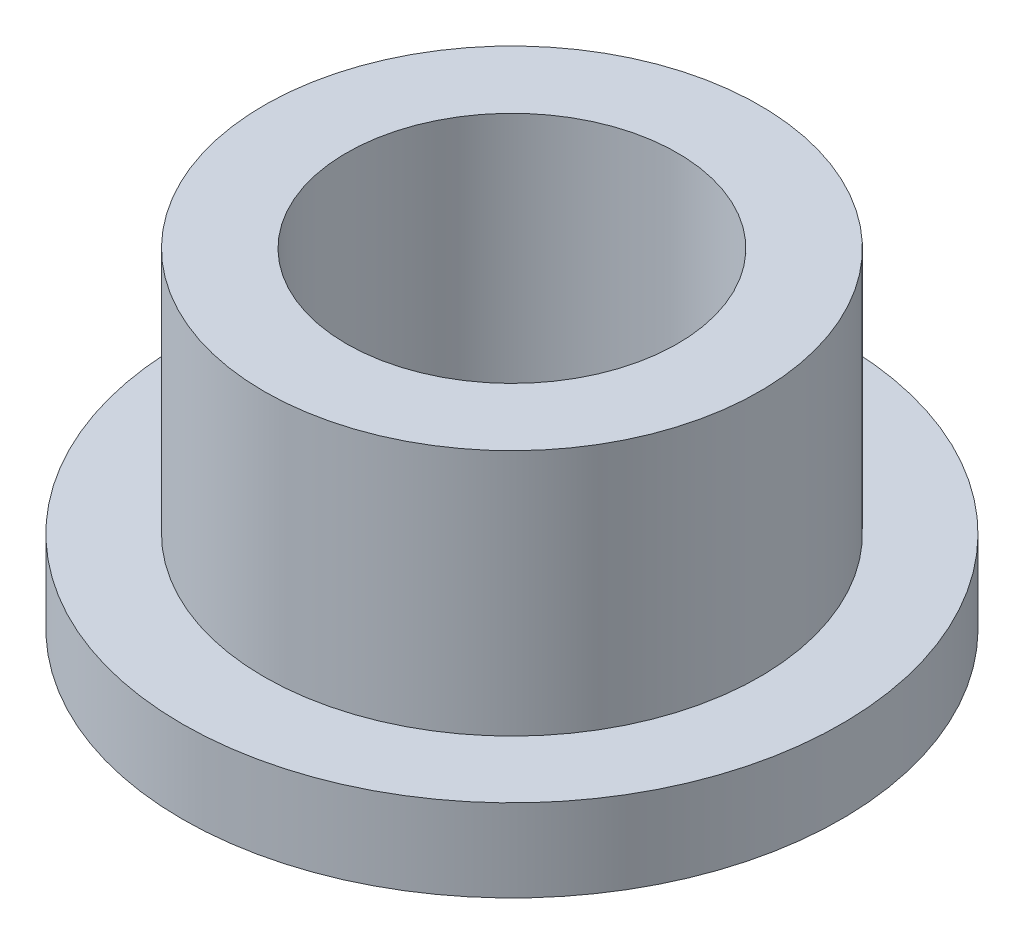
ISO-10303-21;
HEADER;
FILE_DESCRIPTION(('STEP AP214'),'2;1');
FILE_NAME('part.step','',(''),(''),'','','');
FILE_SCHEMA(('AUTOMOTIVE_DESIGN { 1 0 10303 214 1 1 1 1 }'));
ENDSEC;
DATA;
#1=APPLICATION_CONTEXT('core data for automotive mechanical design processes');
#2=APPLICATION_PROTOCOL_DEFINITION('international standard','automotive_design',2000,#1);
#3=PRODUCT_CONTEXT('',#1,'mechanical');
#4=PRODUCT('Part','Part','',(#3));
#5=PRODUCT_RELATED_PRODUCT_CATEGORY('part','',(#4));
#6=PRODUCT_DEFINITION_FORMATION('','',#4);
#7=PRODUCT_DEFINITION_CONTEXT('part definition',#1,'design');
#8=PRODUCT_DEFINITION('design','',#6,#7);
#9=PRODUCT_DEFINITION_SHAPE('','',#8);
#10=(LENGTH_UNIT() NAMED_UNIT(*) SI_UNIT(.MILLI.,.METRE.));
#11=(NAMED_UNIT(*) PLANE_ANGLE_UNIT() SI_UNIT($,.RADIAN.));
#12=(NAMED_UNIT(*) SI_UNIT($,.STERADIAN.) SOLID_ANGLE_UNIT());
#13=UNCERTAINTY_MEASURE_WITH_UNIT(LENGTH_MEASURE(1.E-05),#10,'distance_accuracy_value','');
#14=(GEOMETRIC_REPRESENTATION_CONTEXT(3) GLOBAL_UNCERTAINTY_ASSIGNED_CONTEXT((#13)) GLOBAL_UNIT_ASSIGNED_CONTEXT((#10,
#11,#12)) REPRESENTATION_CONTEXT('',''));
#15=CARTESIAN_POINT('',(0.,0.,0.));
#16=DIRECTION('',(0.,0.,1.));
#17=DIRECTION('',(1.,0.,0.));
#18=AXIS2_PLACEMENT_3D('',#15,#16,#17);
#19=CARTESIAN_POINT('',(0.,12.7,0.));
#20=DIRECTION('',(0.,1.,0.));
#21=DIRECTION('',(0.,0.,1.));
#22=AXIS2_PLACEMENT_3D('',#19,#20,#21);
#23=PLANE('',#22);
#24=CARTESIAN_POINT('',(0.,12.7,0.));
#25=DIRECTION('',(0.,1.,0.));
#26=DIRECTION('',(0.,0.,1.));
#27=AXIS2_PLACEMENT_3D('',#24,#25,#26);
#28=CIRCLE('',#27,9.5504);
#29=CARTESIAN_POINT('',(0.,12.7,9.5504));
#30=VERTEX_POINT('',#29);
#31=EDGE_CURVE('E10',#30,#30,#28,.T.);
#32=ORIENTED_EDGE('',*,*,#31,.T.);
#33=EDGE_LOOP('',(#32));
#34=FACE_BOUND('',#33,.T.);
#35=CARTESIAN_POINT('',(0.,12.7,0.));
#36=DIRECTION('',(0.,1.,0.));
#37=DIRECTION('',(0.,0.,1.));
#38=AXIS2_PLACEMENT_3D('',#35,#36,#37);
#39=CIRCLE('',#38,6.3754);
#40=CARTESIAN_POINT('',(0.,12.7,6.3754));
#41=VERTEX_POINT('',#40);
#42=EDGE_CURVE('E42',#41,#41,#39,.T.);
#43=ORIENTED_EDGE('',*,*,#42,.F.);
#44=EDGE_LOOP('',(#43));
#45=FACE_BOUND('',#44,.T.);
#46=ADVANCED_FACE('F34',(#34,#45),#23,.T.);
#47=CARTESIAN_POINT('',(0.,0.,0.));
#48=DIRECTION('',(0.,1.,0.));
#49=DIRECTION('',(0.,0.,1.));
#50=AXIS2_PLACEMENT_3D('',#47,#48,#49);
#51=PLANE('',#50);
#52=CARTESIAN_POINT('',(0.,0.,0.));
#53=DIRECTION('',(0.,1.,0.));
#54=DIRECTION('',(0.,0.,1.));
#55=AXIS2_PLACEMENT_3D('',#52,#53,#54);
#56=CIRCLE('',#55,6.3754);
#57=CARTESIAN_POINT('',(0.,0.,6.3754));
#58=VERTEX_POINT('',#57);
#59=EDGE_CURVE('E47',#58,#58,#56,.T.);
#60=ORIENTED_EDGE('',*,*,#59,.T.);
#61=EDGE_LOOP('',(#60));
#62=FACE_BOUND('',#61,.T.);
#63=CARTESIAN_POINT('',(0.,0.,0.));
#64=DIRECTION('',(0.,1.,0.));
#65=DIRECTION('',(0.,0.,1.));
#66=AXIS2_PLACEMENT_3D('',#63,#64,#65);
#67=CIRCLE('',#66,12.7);
#68=CARTESIAN_POINT('',(0.,0.,12.7));
#69=VERTEX_POINT('',#68);
#70=EDGE_CURVE('E55',#69,#69,#67,.T.);
#71=ORIENTED_EDGE('',*,*,#70,.F.);
#72=EDGE_LOOP('',(#71));
#73=FACE_BOUND('',#72,.T.);
#74=ADVANCED_FACE('F82',(#62,#73),#51,.F.);
#75=CARTESIAN_POINT('',(0.,12.7,0.));
#76=DIRECTION('',(0.,-1.,0.));
#77=DIRECTION('',(0.,0.,-1.));
#78=AXIS2_PLACEMENT_3D('',#75,#76,#77);
#79=CYLINDRICAL_SURFACE('',#78,9.5504);
#80=CARTESIAN_POINT('',(0.,3.175,0.));
#81=DIRECTION('',(0.,1.,0.));
#82=DIRECTION('',(0.,0.,1.));
#83=AXIS2_PLACEMENT_3D('',#80,#81,#82);
#84=CIRCLE('',#83,9.5504);
#85=CARTESIAN_POINT('',(0.,3.175,9.5504));
#86=VERTEX_POINT('',#85);
#87=EDGE_CURVE('E59',#86,#86,#84,.T.);
#88=ORIENTED_EDGE('',*,*,#87,.T.);
#89=EDGE_LOOP('',(#88));
#90=FACE_BOUND('',#89,.T.);
#91=ORIENTED_EDGE('',*,*,#31,.F.);
#92=EDGE_LOOP('',(#91));
#93=FACE_BOUND('',#92,.T.);
#94=ADVANCED_FACE('F36',(#90,#93),#79,.T.);
#95=CARTESIAN_POINT('',(0.,12.7,0.));
#96=DIRECTION('',(0.,-1.,0.));
#97=DIRECTION('',(0.,0.,-1.));
#98=AXIS2_PLACEMENT_3D('',#95,#96,#97);
#99=CYLINDRICAL_SURFACE('',#98,6.3754);
#100=ORIENTED_EDGE('',*,*,#42,.T.);
#101=EDGE_LOOP('',(#100));
#102=FACE_BOUND('',#101,.T.);
#103=ORIENTED_EDGE('',*,*,#59,.F.);
#104=EDGE_LOOP('',(#103));
#105=FACE_BOUND('',#104,.T.);
#106=ADVANCED_FACE('F71',(#102,#105),#99,.F.);
#107=CARTESIAN_POINT('',(0.,3.175,0.));
#108=DIRECTION('',(0.,1.,0.));
#109=DIRECTION('',(0.,0.,1.));
#110=AXIS2_PLACEMENT_3D('',#107,#108,#109);
#111=PLANE('',#110);
#112=CARTESIAN_POINT('',(0.,3.175,0.));
#113=DIRECTION('',(0.,1.,0.));
#114=DIRECTION('',(0.,0.,1.));
#115=AXIS2_PLACEMENT_3D('',#112,#113,#114);
#116=CIRCLE('',#115,12.7);
#117=CARTESIAN_POINT('',(0.,3.175,12.7));
#118=VERTEX_POINT('',#117);
#119=EDGE_CURVE('E53',#118,#118,#116,.T.);
#120=ORIENTED_EDGE('',*,*,#119,.T.);
#121=EDGE_LOOP('',(#120));
#122=FACE_BOUND('',#121,.T.);
#123=ORIENTED_EDGE('',*,*,#87,.F.);
#124=EDGE_LOOP('',(#123));
#125=FACE_BOUND('',#124,.T.);
#126=ADVANCED_FACE('F68',(#122,#125),#111,.T.);
#127=CARTESIAN_POINT('',(0.,3.175,0.));
#128=DIRECTION('',(0.,-1.,0.));
#129=DIRECTION('',(0.,0.,-1.));
#130=AXIS2_PLACEMENT_3D('',#127,#128,#129);
#131=CYLINDRICAL_SURFACE('',#130,12.7);
#132=ORIENTED_EDGE('',*,*,#119,.F.);
#133=EDGE_LOOP('',(#132));
#134=FACE_BOUND('',#133,.T.);
#135=ORIENTED_EDGE('',*,*,#70,.T.);
#136=EDGE_LOOP('',(#135));
#137=FACE_BOUND('',#136,.T.);
#138=ADVANCED_FACE('F70',(#134,#137),#131,.T.);
#139=CLOSED_SHELL('',(#46,#74,#94,#106,#126,#138));
#140=MANIFOLD_SOLID_BREP('B2',#139);
#141=ADVANCED_BREP_SHAPE_REPRESENTATION('',(#18,#140),#14);
#142=SHAPE_DEFINITION_REPRESENTATION(#9,#141);
ENDSEC;
END-ISO-10303-21;
